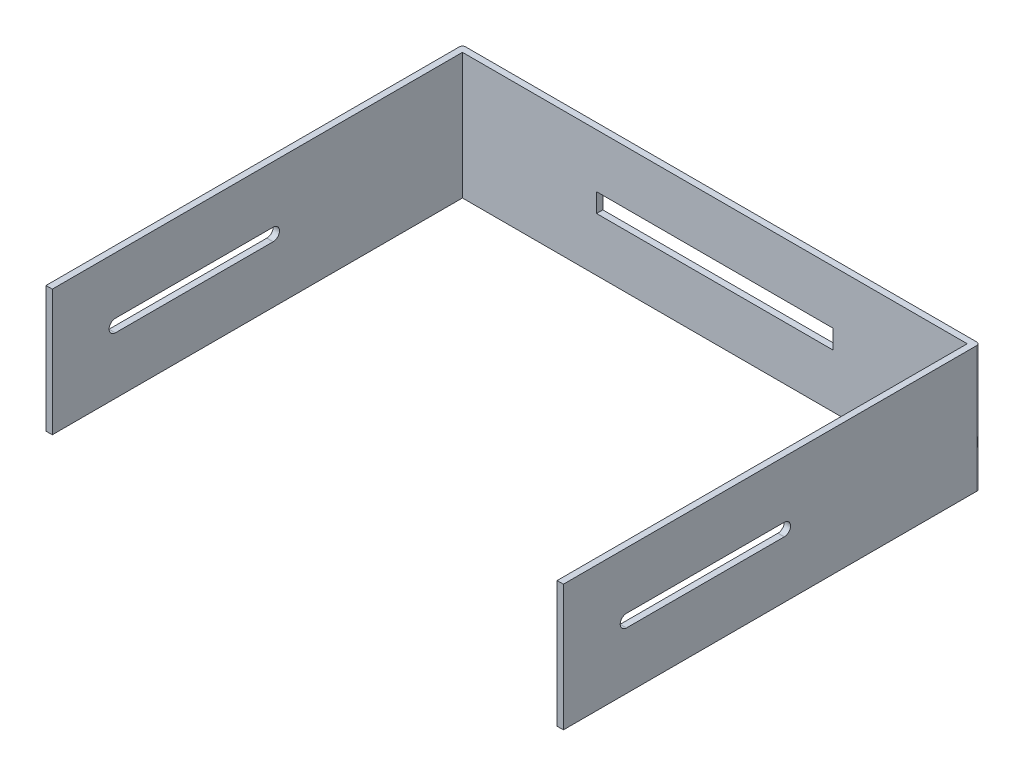
ISO-10303-21;
HEADER;
FILE_DESCRIPTION(('STEP AP214'),'2;1');
FILE_NAME('part.step','',(''),(''),'','','');
FILE_SCHEMA(('AUTOMOTIVE_DESIGN { 1 0 10303 214 1 1 1 1 }'));
ENDSEC;
DATA;
#1=APPLICATION_CONTEXT('core data for automotive mechanical design processes');
#2=APPLICATION_PROTOCOL_DEFINITION('international standard','automotive_design',2000,#1);
#3=PRODUCT_CONTEXT('',#1,'mechanical');
#4=PRODUCT('Part','Part','',(#3));
#5=PRODUCT_RELATED_PRODUCT_CATEGORY('part','',(#4));
#6=PRODUCT_DEFINITION_FORMATION('','',#4);
#7=PRODUCT_DEFINITION_CONTEXT('part definition',#1,'design');
#8=PRODUCT_DEFINITION('design','',#6,#7);
#9=PRODUCT_DEFINITION_SHAPE('','',#8);
#10=(LENGTH_UNIT() NAMED_UNIT(*) SI_UNIT(.MILLI.,.METRE.));
#11=(NAMED_UNIT(*) PLANE_ANGLE_UNIT() SI_UNIT($,.RADIAN.));
#12=(NAMED_UNIT(*) SI_UNIT($,.STERADIAN.) SOLID_ANGLE_UNIT());
#13=UNCERTAINTY_MEASURE_WITH_UNIT(LENGTH_MEASURE(1.E-05),#10,'distance_accuracy_value','');
#14=(GEOMETRIC_REPRESENTATION_CONTEXT(3) GLOBAL_UNCERTAINTY_ASSIGNED_CONTEXT((#13)) GLOBAL_UNIT_ASSIGNED_CONTEXT((#10,
#11,#12)) REPRESENTATION_CONTEXT('',''));
#15=CARTESIAN_POINT('',(0.,0.,0.));
#16=DIRECTION('',(0.,0.,1.));
#17=DIRECTION('',(1.,0.,0.));
#18=AXIS2_PLACEMENT_3D('',#15,#16,#17);
#19=CARTESIAN_POINT('',(0.,0.,2.));
#20=DIRECTION('',(0.,0.,1.));
#21=DIRECTION('',(1.,0.,0.));
#22=AXIS2_PLACEMENT_3D('',#19,#20,#21);
#23=PLANE('',#22);
#24=DIRECTION('',(0.,-1.,0.));
#25=VECTOR('',#24,1.);
#26=CARTESIAN_POINT('',(44.5,-17.,2.));
#27=LINE('',#26,#25);
#28=CARTESIAN_POINT('',(44.5,-17.,2.));
#29=VERTEX_POINT('',#28);
#30=CARTESIAN_POINT('',(44.5,-23.,2.));
#31=VERTEX_POINT('',#30);
#32=EDGE_CURVE('E231',#29,#31,#27,.T.);
#33=ORIENTED_EDGE('',*,*,#32,.F.);
#34=DIRECTION('',(-1.,0.,0.));
#35=VECTOR('',#34,1.);
#36=CARTESIAN_POINT('',(44.5,-17.,2.));
#37=LINE('',#36,#35);
#38=CARTESIAN_POINT('',(119.5,-17.,2.));
#39=VERTEX_POINT('',#38);
#40=EDGE_CURVE('E239',#39,#29,#37,.T.);
#41=ORIENTED_EDGE('',*,*,#40,.F.);
#42=DIRECTION('',(0.,1.,0.));
#43=VECTOR('',#42,1.);
#44=CARTESIAN_POINT('',(119.5,-17.,2.));
#45=LINE('',#44,#43);
#46=CARTESIAN_POINT('',(119.5,-23.,2.));
#47=VERTEX_POINT('',#46);
#48=EDGE_CURVE('E236',#47,#39,#45,.T.);
#49=ORIENTED_EDGE('',*,*,#48,.F.);
#50=DIRECTION('',(1.,0.,0.));
#51=VECTOR('',#50,1.);
#52=CARTESIAN_POINT('',(44.5,-23.,2.));
#53=LINE('',#52,#51);
#54=EDGE_CURVE('E233',#31,#47,#53,.T.);
#55=ORIENTED_EDGE('',*,*,#54,.F.);
#56=EDGE_LOOP('',(#33,#41,#49,#55));
#57=FACE_BOUND('',#56,.T.);
#58=DIRECTION('',(1.,0.,0.));
#59=VECTOR('',#58,1.);
#60=CARTESIAN_POINT('',(0.,-40.,2.));
#61=LINE('',#60,#59);
#62=CARTESIAN_POINT('',(2.,-40.,2.));
#63=VERTEX_POINT('',#62);
#64=CARTESIAN_POINT('',(162.,-40.,2.));
#65=VERTEX_POINT('',#64);
#66=EDGE_CURVE('E299',#63,#65,#61,.T.);
#67=ORIENTED_EDGE('',*,*,#66,.T.);
#68=DIRECTION('',(0.,-1.,0.));
#69=VECTOR('',#68,1.);
#70=CARTESIAN_POINT('',(162.,0.,2.));
#71=LINE('',#70,#69);
#72=CARTESIAN_POINT('',(162.,0.,2.));
#73=VERTEX_POINT('',#72);
#74=EDGE_CURVE('E260',#73,#65,#71,.T.);
#75=ORIENTED_EDGE('',*,*,#74,.F.);
#76=DIRECTION('',(-1.,0.,0.));
#77=VECTOR('',#76,1.);
#78=CARTESIAN_POINT('',(0.,0.,2.));
#79=LINE('',#78,#77);
#80=CARTESIAN_POINT('',(2.,0.,2.));
#81=VERTEX_POINT('',#80);
#82=EDGE_CURVE('E311',#73,#81,#79,.T.);
#83=ORIENTED_EDGE('',*,*,#82,.T.);
#84=DIRECTION('',(0.,1.,0.));
#85=VECTOR('',#84,1.);
#86=CARTESIAN_POINT('',(2.,0.,2.));
#87=LINE('',#86,#85);
#88=EDGE_CURVE('E279',#63,#81,#87,.T.);
#89=ORIENTED_EDGE('',*,*,#88,.F.);
#90=EDGE_LOOP('',(#67,#75,#83,#89));
#91=FACE_BOUND('',#90,.T.);
#92=ADVANCED_FACE('F33',(#57,#91),#23,.T.);
#93=CARTESIAN_POINT('',(0.,0.,2.));
#94=DIRECTION('',(1.,0.,0.));
#95=DIRECTION('',(0.,1.,0.));
#96=AXIS2_PLACEMENT_3D('',#93,#94,#95);
#97=PLANE('',#96);
#98=CARTESIAN_POINT('',(0.,-20.,62.));
#99=DIRECTION('',(-1.,0.,0.));
#100=DIRECTION('',(0.,-1.,0.));
#101=AXIS2_PLACEMENT_3D('',#98,#99,#100);
#102=CIRCLE('',#101,2.);
#103=CARTESIAN_POINT('',(0.,-18.,62.));
#104=VERTEX_POINT('',#103);
#105=CARTESIAN_POINT('',(0.,-22.,62.));
#106=VERTEX_POINT('',#105);
#107=EDGE_CURVE('E208',#104,#106,#102,.T.);
#108=ORIENTED_EDGE('',*,*,#107,.F.);
#109=DIRECTION('',(0.,0.,-1.));
#110=VECTOR('',#109,1.);
#111=CARTESIAN_POINT('',(0.,-18.,62.));
#112=LINE('',#111,#110);
#113=CARTESIAN_POINT('',(0.,-18.,112.));
#114=VERTEX_POINT('',#113);
#115=EDGE_CURVE('E202',#114,#104,#112,.T.);
#116=ORIENTED_EDGE('',*,*,#115,.F.);
#117=CARTESIAN_POINT('',(0.,-20.,112.));
#118=DIRECTION('',(-1.,0.,0.));
#119=DIRECTION('',(0.,-1.,0.));
#120=AXIS2_PLACEMENT_3D('',#117,#118,#119);
#121=CIRCLE('',#120,2.);
#122=CARTESIAN_POINT('',(0.,-22.,112.));
#123=VERTEX_POINT('',#122);
#124=EDGE_CURVE('E245',#123,#114,#121,.T.);
#125=ORIENTED_EDGE('',*,*,#124,.F.);
#126=DIRECTION('',(0.,0.,1.));
#127=VECTOR('',#126,1.);
#128=CARTESIAN_POINT('',(0.,-22.,62.));
#129=LINE('',#128,#127);
#130=EDGE_CURVE('E56',#106,#123,#129,.T.);
#131=ORIENTED_EDGE('',*,*,#130,.F.);
#132=EDGE_LOOP('',(#108,#116,#125,#131));
#133=FACE_BOUND('',#132,.T.);
#134=DIRECTION('',(0.,0.,-1.));
#135=VECTOR('',#134,1.);
#136=CARTESIAN_POINT('',(0.,0.,2.));
#137=LINE('',#136,#135);
#138=CARTESIAN_POINT('',(0.,0.,132.));
#139=VERTEX_POINT('',#138);
#140=CARTESIAN_POINT('',(0.,0.,1.));
#141=VERTEX_POINT('',#140);
#142=EDGE_CURVE('E313',#139,#141,#137,.T.);
#143=ORIENTED_EDGE('',*,*,#142,.T.);
#144=DIRECTION('',(0.,-1.,0.));
#145=VECTOR('',#144,1.);
#146=CARTESIAN_POINT('',(0.,0.,1.));
#147=LINE('',#146,#145);
#148=CARTESIAN_POINT('',(0.,-40.,1.));
#149=VERTEX_POINT('',#148);
#150=EDGE_CURVE('E330',#141,#149,#147,.T.);
#151=ORIENTED_EDGE('',*,*,#150,.T.);
#152=DIRECTION('',(0.,0.,-1.));
#153=VECTOR('',#152,1.);
#154=CARTESIAN_POINT('',(0.,-40.,2.));
#155=LINE('',#154,#153);
#156=CARTESIAN_POINT('',(0.,-40.,132.));
#157=VERTEX_POINT('',#156);
#158=EDGE_CURVE('E328',#157,#149,#155,.T.);
#159=ORIENTED_EDGE('',*,*,#158,.F.);
#160=DIRECTION('',(0.,-1.,0.));
#161=VECTOR('',#160,1.);
#162=CARTESIAN_POINT('',(0.,0.,132.));
#163=LINE('',#162,#161);
#164=EDGE_CURVE('E280',#139,#157,#163,.T.);
#165=ORIENTED_EDGE('',*,*,#164,.F.);
#166=EDGE_LOOP('',(#143,#151,#159,#165));
#167=FACE_BOUND('',#166,.T.);
#168=ADVANCED_FACE('F383',(#133,#167),#97,.F.);
#169=CARTESIAN_POINT('',(0.,-40.,2.));
#170=DIRECTION('',(0.,1.,0.));
#171=DIRECTION('',(0.,0.,1.));
#172=AXIS2_PLACEMENT_3D('',#169,#170,#171);
#173=PLANE('',#172);
#174=DIRECTION('',(1.,0.,0.));
#175=VECTOR('',#174,1.);
#176=CARTESIAN_POINT('',(0.,-40.,0.));
#177=LINE('',#176,#175);
#178=CARTESIAN_POINT('',(1.00000000000001,-40.,0.));
#179=VERTEX_POINT('',#178);
#180=CARTESIAN_POINT('',(163.,-40.,0.));
#181=VERTEX_POINT('',#180);
#182=EDGE_CURVE('E308',#179,#181,#177,.T.);
#183=ORIENTED_EDGE('',*,*,#182,.T.);
#184=CARTESIAN_POINT('',(163.,-40.,1.));
#185=DIRECTION('',(0.,1.,0.));
#186=DIRECTION('',(0.,0.,1.));
#187=AXIS2_PLACEMENT_3D('',#184,#185,#186);
#188=CIRCLE('',#187,1.);
#189=CARTESIAN_POINT('',(164.,-40.,1.));
#190=VERTEX_POINT('',#189);
#191=EDGE_CURVE('E351',#181,#190,#188,.F.);
#192=ORIENTED_EDGE('',*,*,#191,.T.);
#193=DIRECTION('',(0.,0.,-1.));
#194=VECTOR('',#193,1.);
#195=CARTESIAN_POINT('',(164.,-40.,2.));
#196=LINE('',#195,#194);
#197=CARTESIAN_POINT('',(164.,-40.,132.));
#198=VERTEX_POINT('',#197);
#199=EDGE_CURVE('E326',#198,#190,#196,.T.);
#200=ORIENTED_EDGE('',*,*,#199,.F.);
#201=DIRECTION('',(1.,0.,0.));
#202=VECTOR('',#201,1.);
#203=CARTESIAN_POINT('',(164.,-40.,132.));
#204=LINE('',#203,#202);
#205=CARTESIAN_POINT('',(162.,-40.,132.));
#206=VERTEX_POINT('',#205);
#207=EDGE_CURVE('E268',#206,#198,#204,.T.);
#208=ORIENTED_EDGE('',*,*,#207,.F.);
#209=DIRECTION('',(0.,0.,-1.));
#210=VECTOR('',#209,1.);
#211=CARTESIAN_POINT('',(162.,-40.,132.));
#212=LINE('',#211,#210);
#213=EDGE_CURVE('E271',#206,#65,#212,.T.);
#214=ORIENTED_EDGE('',*,*,#213,.T.);
#215=ORIENTED_EDGE('',*,*,#66,.F.);
#216=DIRECTION('',(0.,0.,-1.));
#217=VECTOR('',#216,1.);
#218=CARTESIAN_POINT('',(2.00000000000001,-40.,132.));
#219=LINE('',#218,#217);
#220=CARTESIAN_POINT('',(2.00000000000001,-40.,132.));
#221=VERTEX_POINT('',#220);
#222=EDGE_CURVE('E303',#221,#63,#219,.T.);
#223=ORIENTED_EDGE('',*,*,#222,.F.);
#224=DIRECTION('',(1.,0.,0.));
#225=VECTOR('',#224,1.);
#226=CARTESIAN_POINT('',(0.,-40.,132.));
#227=LINE('',#226,#225);
#228=EDGE_CURVE('E283',#157,#221,#227,.T.);
#229=ORIENTED_EDGE('',*,*,#228,.F.);
#230=ORIENTED_EDGE('',*,*,#158,.T.);
#231=CARTESIAN_POINT('',(1.00000000000001,-40.,1.));
#232=DIRECTION('',(0.,1.,0.));
#233=DIRECTION('',(0.,0.,1.));
#234=AXIS2_PLACEMENT_3D('',#231,#232,#233);
#235=CIRCLE('',#234,1.);
#236=EDGE_CURVE('E334',#149,#179,#235,.F.);
#237=ORIENTED_EDGE('',*,*,#236,.T.);
#238=EDGE_LOOP('',(#183,#192,#200,#208,#214,#215,#223,#229,#230,#237));
#239=FACE_BOUND('',#238,.T.);
#240=ADVANCED_FACE('F403',(#239),#173,.F.);
#241=CARTESIAN_POINT('',(164.,0.,2.));
#242=DIRECTION('',(-1.,0.,0.));
#243=DIRECTION('',(0.,0.,1.));
#244=AXIS2_PLACEMENT_3D('',#241,#242,#243);
#245=PLANE('',#244);
#246=CARTESIAN_POINT('',(164.,-20.,112.));
#247=DIRECTION('',(-1.,0.,0.));
#248=DIRECTION('',(0.,-1.,0.));
#249=AXIS2_PLACEMENT_3D('',#246,#247,#248);
#250=CIRCLE('',#249,2.);
#251=CARTESIAN_POINT('',(164.,-22.,112.));
#252=VERTEX_POINT('',#251);
#253=CARTESIAN_POINT('',(164.,-18.,112.));
#254=VERTEX_POINT('',#253);
#255=EDGE_CURVE('E252',#252,#254,#250,.T.);
#256=ORIENTED_EDGE('',*,*,#255,.T.);
#257=DIRECTION('',(0.,0.,-1.));
#258=VECTOR('',#257,1.);
#259=CARTESIAN_POINT('',(164.,-18.,62.));
#260=LINE('',#259,#258);
#261=CARTESIAN_POINT('',(164.,-18.,62.));
#262=VERTEX_POINT('',#261);
#263=EDGE_CURVE('E198',#254,#262,#260,.T.);
#264=ORIENTED_EDGE('',*,*,#263,.T.);
#265=CARTESIAN_POINT('',(164.,-20.,62.));
#266=DIRECTION('',(-1.,0.,0.));
#267=DIRECTION('',(0.,-1.,0.));
#268=AXIS2_PLACEMENT_3D('',#265,#266,#267);
#269=CIRCLE('',#268,2.);
#270=CARTESIAN_POINT('',(164.,-22.,62.));
#271=VERTEX_POINT('',#270);
#272=EDGE_CURVE('E187',#262,#271,#269,.T.);
#273=ORIENTED_EDGE('',*,*,#272,.T.);
#274=DIRECTION('',(0.,0.,1.));
#275=VECTOR('',#274,1.);
#276=CARTESIAN_POINT('',(164.,-22.,62.));
#277=LINE('',#276,#275);
#278=EDGE_CURVE('E193',#271,#252,#277,.T.);
#279=ORIENTED_EDGE('',*,*,#278,.T.);
#280=EDGE_LOOP('',(#256,#264,#273,#279));
#281=FACE_BOUND('',#280,.T.);
#282=ORIENTED_EDGE('',*,*,#199,.T.);
#283=DIRECTION('',(0.,1.,0.));
#284=VECTOR('',#283,1.);
#285=CARTESIAN_POINT('',(164.,0.,1.));
#286=LINE('',#285,#284);
#287=CARTESIAN_POINT('',(164.,0.,1.));
#288=VERTEX_POINT('',#287);
#289=EDGE_CURVE('E344',#190,#288,#286,.T.);
#290=ORIENTED_EDGE('',*,*,#289,.T.);
#291=DIRECTION('',(0.,0.,-1.));
#292=VECTOR('',#291,1.);
#293=CARTESIAN_POINT('',(164.,0.,2.));
#294=LINE('',#293,#292);
#295=CARTESIAN_POINT('',(164.,0.,132.));
#296=VERTEX_POINT('',#295);
#297=EDGE_CURVE('E323',#296,#288,#294,.T.);
#298=ORIENTED_EDGE('',*,*,#297,.F.);
#299=DIRECTION('',(0.,1.,0.));
#300=VECTOR('',#299,1.);
#301=CARTESIAN_POINT('',(164.,0.,132.));
#302=LINE('',#301,#300);
#303=EDGE_CURVE('E261',#198,#296,#302,.T.);
#304=ORIENTED_EDGE('',*,*,#303,.F.);
#305=EDGE_LOOP('',(#282,#290,#298,#304));
#306=FACE_BOUND('',#305,.T.);
#307=ADVANCED_FACE('F200',(#281,#306),#245,.F.);
#308=CARTESIAN_POINT('',(0.,0.,2.));
#309=DIRECTION('',(0.,-1.,0.));
#310=DIRECTION('',(0.,0.,-1.));
#311=AXIS2_PLACEMENT_3D('',#308,#309,#310);
#312=PLANE('',#311);
#313=ORIENTED_EDGE('',*,*,#297,.T.);
#314=CARTESIAN_POINT('',(163.,0.,1.));
#315=DIRECTION('',(0.,-1.,0.));
#316=DIRECTION('',(0.,0.,-1.));
#317=AXIS2_PLACEMENT_3D('',#314,#315,#316);
#318=CIRCLE('',#317,1.);
#319=CARTESIAN_POINT('',(163.,0.,0.));
#320=VERTEX_POINT('',#319);
#321=EDGE_CURVE('E347',#288,#320,#318,.F.);
#322=ORIENTED_EDGE('',*,*,#321,.T.);
#323=DIRECTION('',(-1.,0.,0.));
#324=VECTOR('',#323,1.);
#325=CARTESIAN_POINT('',(0.,0.,0.));
#326=LINE('',#325,#324);
#327=CARTESIAN_POINT('',(1.,0.,0.));
#328=VERTEX_POINT('',#327);
#329=EDGE_CURVE('E319',#320,#328,#326,.T.);
#330=ORIENTED_EDGE('',*,*,#329,.T.);
#331=CARTESIAN_POINT('',(1.,0.,1.));
#332=DIRECTION('',(0.,-1.,0.));
#333=DIRECTION('',(0.,0.,-1.));
#334=AXIS2_PLACEMENT_3D('',#331,#332,#333);
#335=CIRCLE('',#334,1.);
#336=EDGE_CURVE('E342',#328,#141,#335,.F.);
#337=ORIENTED_EDGE('',*,*,#336,.T.);
#338=ORIENTED_EDGE('',*,*,#142,.F.);
#339=DIRECTION('',(-1.,0.,0.));
#340=VECTOR('',#339,1.);
#341=CARTESIAN_POINT('',(0.,0.,132.));
#342=LINE('',#341,#340);
#343=CARTESIAN_POINT('',(2.,0.,132.));
#344=VERTEX_POINT('',#343);
#345=EDGE_CURVE('E287',#344,#139,#342,.T.);
#346=ORIENTED_EDGE('',*,*,#345,.F.);
#347=DIRECTION('',(0.,0.,-1.));
#348=VECTOR('',#347,1.);
#349=CARTESIAN_POINT('',(2.,0.,132.));
#350=LINE('',#349,#348);
#351=EDGE_CURVE('E290',#344,#81,#350,.T.);
#352=ORIENTED_EDGE('',*,*,#351,.T.);
#353=ORIENTED_EDGE('',*,*,#82,.F.);
#354=DIRECTION('',(0.,0.,-1.));
#355=VECTOR('',#354,1.);
#356=CARTESIAN_POINT('',(162.,0.,132.));
#357=LINE('',#356,#355);
#358=CARTESIAN_POINT('',(162.,0.,132.));
#359=VERTEX_POINT('',#358);
#360=EDGE_CURVE('E276',#359,#73,#357,.T.);
#361=ORIENTED_EDGE('',*,*,#360,.F.);
#362=DIRECTION('',(-1.,0.,0.));
#363=VECTOR('',#362,1.);
#364=CARTESIAN_POINT('',(164.,0.,132.));
#365=LINE('',#364,#363);
#366=EDGE_CURVE('E264',#296,#359,#365,.T.);
#367=ORIENTED_EDGE('',*,*,#366,.F.);
#368=EDGE_LOOP('',(#313,#322,#330,#337,#338,#346,#352,#353,#361,#367));
#369=FACE_BOUND('',#368,.T.);
#370=ADVANCED_FACE('F413',(#369),#312,.F.);
#371=CARTESIAN_POINT('',(0.,0.,0.));
#372=DIRECTION('',(0.,0.,1.));
#373=DIRECTION('',(1.,0.,0.));
#374=AXIS2_PLACEMENT_3D('',#371,#372,#373);
#375=PLANE('',#374);
#376=DIRECTION('',(-1.,0.,0.));
#377=VECTOR('',#376,1.);
#378=CARTESIAN_POINT('',(0.,-17.,0.));
#379=LINE('',#378,#377);
#380=CARTESIAN_POINT('',(119.5,-17.,0.));
#381=VERTEX_POINT('',#380);
#382=CARTESIAN_POINT('',(44.5,-17.,0.));
#383=VERTEX_POINT('',#382);
#384=EDGE_CURVE('E359',#381,#383,#379,.T.);
#385=ORIENTED_EDGE('',*,*,#384,.T.);
#386=DIRECTION('',(0.,-1.,0.));
#387=VECTOR('',#386,1.);
#388=CARTESIAN_POINT('',(44.5,0.,0.));
#389=LINE('',#388,#387);
#390=CARTESIAN_POINT('',(44.5,-23.,0.));
#391=VERTEX_POINT('',#390);
#392=EDGE_CURVE('E362',#383,#391,#389,.T.);
#393=ORIENTED_EDGE('',*,*,#392,.T.);
#394=DIRECTION('',(1.,0.,0.));
#395=VECTOR('',#394,1.);
#396=CARTESIAN_POINT('',(0.,-23.,0.));
#397=LINE('',#396,#395);
#398=CARTESIAN_POINT('',(119.5,-23.,0.));
#399=VERTEX_POINT('',#398);
#400=EDGE_CURVE('E353',#391,#399,#397,.T.);
#401=ORIENTED_EDGE('',*,*,#400,.T.);
#402=DIRECTION('',(0.,1.,0.));
#403=VECTOR('',#402,1.);
#404=CARTESIAN_POINT('',(119.5,0.,0.));
#405=LINE('',#404,#403);
#406=EDGE_CURVE('E356',#399,#381,#405,.T.);
#407=ORIENTED_EDGE('',*,*,#406,.T.);
#408=EDGE_LOOP('',(#385,#393,#401,#407));
#409=FACE_BOUND('',#408,.T.);
#410=ORIENTED_EDGE('',*,*,#329,.F.);
#411=DIRECTION('',(0.,1.,0.));
#412=VECTOR('',#411,1.);
#413=CARTESIAN_POINT('',(163.,0.,0.));
#414=LINE('',#413,#412);
#415=EDGE_CURVE('E349',#320,#181,#414,.F.);
#416=ORIENTED_EDGE('',*,*,#415,.T.);
#417=ORIENTED_EDGE('',*,*,#182,.F.);
#418=DIRECTION('',(0.,-1.,0.));
#419=VECTOR('',#418,1.);
#420=CARTESIAN_POINT('',(1.,0.,0.));
#421=LINE('',#420,#419);
#422=EDGE_CURVE('E337',#179,#328,#421,.F.);
#423=ORIENTED_EDGE('',*,*,#422,.T.);
#424=EDGE_LOOP('',(#410,#416,#417,#423));
#425=FACE_BOUND('',#424,.T.);
#426=ADVANCED_FACE('F410',(#409,#425),#375,.F.);
#427=CARTESIAN_POINT('',(2.,0.,132.));
#428=DIRECTION('',(-1.,0.,0.));
#429=DIRECTION('',(0.,-1.,0.));
#430=AXIS2_PLACEMENT_3D('',#427,#428,#429);
#431=PLANE('',#430);
#432=CARTESIAN_POINT('',(2.,-20.,112.));
#433=DIRECTION('',(-1.,0.,0.));
#434=DIRECTION('',(0.,-1.,0.));
#435=AXIS2_PLACEMENT_3D('',#432,#433,#434);
#436=CIRCLE('',#435,2.);
#437=CARTESIAN_POINT('',(2.,-22.,112.));
#438=VERTEX_POINT('',#437);
#439=CARTESIAN_POINT('',(2.,-18.,112.));
#440=VERTEX_POINT('',#439);
#441=EDGE_CURVE('E257',#438,#440,#436,.T.);
#442=ORIENTED_EDGE('',*,*,#441,.T.);
#443=DIRECTION('',(0.,0.,-1.));
#444=VECTOR('',#443,1.);
#445=CARTESIAN_POINT('',(2.,-18.,132.));
#446=LINE('',#445,#444);
#447=CARTESIAN_POINT('',(2.,-18.,62.));
#448=VERTEX_POINT('',#447);
#449=EDGE_CURVE('E225',#440,#448,#446,.T.);
#450=ORIENTED_EDGE('',*,*,#449,.T.);
#451=CARTESIAN_POINT('',(2.,-20.,62.));
#452=DIRECTION('',(-1.,0.,0.));
#453=DIRECTION('',(0.,-1.,0.));
#454=AXIS2_PLACEMENT_3D('',#451,#452,#453);
#455=CIRCLE('',#454,2.);
#456=CARTESIAN_POINT('',(2.,-22.,62.));
#457=VERTEX_POINT('',#456);
#458=EDGE_CURVE('E228',#448,#457,#455,.T.);
#459=ORIENTED_EDGE('',*,*,#458,.T.);
#460=DIRECTION('',(0.,0.,1.));
#461=VECTOR('',#460,1.);
#462=CARTESIAN_POINT('',(2.,-22.,132.));
#463=LINE('',#462,#461);
#464=EDGE_CURVE('E219',#457,#438,#463,.T.);
#465=ORIENTED_EDGE('',*,*,#464,.T.);
#466=EDGE_LOOP('',(#442,#450,#459,#465));
#467=FACE_BOUND('',#466,.T.);
#468=ORIENTED_EDGE('',*,*,#88,.T.);
#469=ORIENTED_EDGE('',*,*,#351,.F.);
#470=DIRECTION('',(0.,1.,0.));
#471=VECTOR('',#470,1.);
#472=CARTESIAN_POINT('',(2.,0.,132.));
#473=LINE('',#472,#471);
#474=EDGE_CURVE('E285',#221,#344,#473,.T.);
#475=ORIENTED_EDGE('',*,*,#474,.F.);
#476=ORIENTED_EDGE('',*,*,#222,.T.);
#477=EDGE_LOOP('',(#468,#469,#475,#476));
#478=FACE_BOUND('',#477,.T.);
#479=ADVANCED_FACE('F374',(#467,#478),#431,.F.);
#480=CARTESIAN_POINT('',(0.,0.,132.));
#481=DIRECTION('',(0.,0.,1.));
#482=DIRECTION('',(1.,0.,0.));
#483=AXIS2_PLACEMENT_3D('',#480,#481,#482);
#484=PLANE('',#483);
#485=ORIENTED_EDGE('',*,*,#164,.T.);
#486=ORIENTED_EDGE('',*,*,#228,.T.);
#487=ORIENTED_EDGE('',*,*,#474,.T.);
#488=ORIENTED_EDGE('',*,*,#345,.T.);
#489=EDGE_LOOP('',(#485,#486,#487,#488));
#490=FACE_BOUND('',#489,.T.);
#491=ADVANCED_FACE('F438',(#490),#484,.T.);
#492=CARTESIAN_POINT('',(162.,0.,132.));
#493=DIRECTION('',(1.,0.,0.));
#494=DIRECTION('',(0.,0.,-1.));
#495=AXIS2_PLACEMENT_3D('',#492,#493,#494);
#496=PLANE('',#495);
#497=CARTESIAN_POINT('',(162.,-20.,62.));
#498=DIRECTION('',(1.,0.,0.));
#499=DIRECTION('',(0.,0.,-1.));
#500=AXIS2_PLACEMENT_3D('',#497,#498,#499);
#501=CIRCLE('',#500,2.);
#502=CARTESIAN_POINT('',(162.,-22.,62.));
#503=VERTEX_POINT('',#502);
#504=CARTESIAN_POINT('',(162.,-18.,62.));
#505=VERTEX_POINT('',#504);
#506=EDGE_CURVE('E11',#503,#505,#501,.T.);
#507=ORIENTED_EDGE('',*,*,#506,.T.);
#508=DIRECTION('',(0.,0.,1.));
#509=VECTOR('',#508,1.);
#510=CARTESIAN_POINT('',(162.,-18.,132.));
#511=LINE('',#510,#509);
#512=CARTESIAN_POINT('',(162.,-18.,112.));
#513=VERTEX_POINT('',#512);
#514=EDGE_CURVE('E222',#505,#513,#511,.T.);
#515=ORIENTED_EDGE('',*,*,#514,.T.);
#516=CARTESIAN_POINT('',(162.,-20.,112.));
#517=DIRECTION('',(1.,0.,0.));
#518=DIRECTION('',(0.,0.,-1.));
#519=AXIS2_PLACEMENT_3D('',#516,#517,#518);
#520=CIRCLE('',#519,2.);
#521=CARTESIAN_POINT('',(162.,-22.,112.));
#522=VERTEX_POINT('',#521);
#523=EDGE_CURVE('E254',#513,#522,#520,.T.);
#524=ORIENTED_EDGE('',*,*,#523,.T.);
#525=DIRECTION('',(0.,0.,-1.));
#526=VECTOR('',#525,1.);
#527=CARTESIAN_POINT('',(162.,-22.,132.));
#528=LINE('',#527,#526);
#529=EDGE_CURVE('E48',#522,#503,#528,.T.);
#530=ORIENTED_EDGE('',*,*,#529,.T.);
#531=EDGE_LOOP('',(#507,#515,#524,#530));
#532=FACE_BOUND('',#531,.T.);
#533=ORIENTED_EDGE('',*,*,#74,.T.);
#534=ORIENTED_EDGE('',*,*,#213,.F.);
#535=DIRECTION('',(0.,-1.,0.));
#536=VECTOR('',#535,1.);
#537=CARTESIAN_POINT('',(162.,0.,132.));
#538=LINE('',#537,#536);
#539=EDGE_CURVE('E266',#359,#206,#538,.T.);
#540=ORIENTED_EDGE('',*,*,#539,.F.);
#541=ORIENTED_EDGE('',*,*,#360,.T.);
#542=EDGE_LOOP('',(#533,#534,#540,#541));
#543=FACE_BOUND('',#542,.T.);
#544=ADVANCED_FACE('F449',(#532,#543),#496,.F.);
#545=CARTESIAN_POINT('',(0.,0.,132.));
#546=DIRECTION('',(0.,0.,-1.));
#547=DIRECTION('',(-1.,0.,0.));
#548=AXIS2_PLACEMENT_3D('',#545,#546,#547);
#549=PLANE('',#548);
#550=ORIENTED_EDGE('',*,*,#303,.T.);
#551=ORIENTED_EDGE('',*,*,#366,.T.);
#552=ORIENTED_EDGE('',*,*,#539,.T.);
#553=ORIENTED_EDGE('',*,*,#207,.T.);
#554=EDGE_LOOP('',(#550,#551,#552,#553));
#555=FACE_BOUND('',#554,.T.);
#556=ADVANCED_FACE('F453',(#555),#549,.F.);
#557=CARTESIAN_POINT('',(164.,-20.,112.));
#558=DIRECTION('',(-1.,0.,0.));
#559=DIRECTION('',(0.,-1.,0.));
#560=AXIS2_PLACEMENT_3D('',#557,#558,#559);
#561=CYLINDRICAL_SURFACE('',#560,2.);
#562=ORIENTED_EDGE('',*,*,#523,.F.);
#563=DIRECTION('',(-1.,0.,0.));
#564=VECTOR('',#563,1.);
#565=CARTESIAN_POINT('',(164.,-18.,112.));
#566=LINE('',#565,#564);
#567=EDGE_CURVE('E215',#254,#513,#566,.T.);
#568=ORIENTED_EDGE('',*,*,#567,.F.);
#569=ORIENTED_EDGE('',*,*,#255,.F.);
#570=DIRECTION('',(-1.,0.,0.));
#571=VECTOR('',#570,1.);
#572=CARTESIAN_POINT('',(164.,-22.,112.));
#573=LINE('',#572,#571);
#574=EDGE_CURVE('E189',#252,#522,#573,.T.);
#575=ORIENTED_EDGE('',*,*,#574,.T.);
#576=EDGE_LOOP('',(#562,#568,#569,#575));
#577=FACE_BOUND('',#576,.T.);
#578=ADVANCED_FACE('F430',(#577),#561,.F.);
#579=ORIENTED_EDGE('',*,*,#124,.T.);
#580=DIRECTION('',(-1.,0.,0.));
#581=VECTOR('',#580,1.);
#582=CARTESIAN_POINT('',(164.,-18.,112.));
#583=LINE('',#582,#581);
#584=EDGE_CURVE('E41',#114,#440,#583,.F.);
#585=ORIENTED_EDGE('',*,*,#584,.T.);
#586=ORIENTED_EDGE('',*,*,#441,.F.);
#587=DIRECTION('',(-1.,0.,0.));
#588=VECTOR('',#587,1.);
#589=CARTESIAN_POINT('',(164.,-22.,112.));
#590=LINE('',#589,#588);
#591=EDGE_CURVE('E365',#123,#438,#590,.F.);
#592=ORIENTED_EDGE('',*,*,#591,.F.);
#593=EDGE_LOOP('',(#579,#585,#586,#592));
#594=FACE_BOUND('',#593,.T.);
#595=ADVANCED_FACE('F369',(#594),#561,.F.);
#596=CARTESIAN_POINT('',(1.,0.,1.));
#597=DIRECTION('',(0.,-1.,0.));
#598=DIRECTION('',(1.,0.,0.));
#599=AXIS2_PLACEMENT_3D('',#596,#597,#598);
#600=CYLINDRICAL_SURFACE('',#599,1.);
#601=ORIENTED_EDGE('',*,*,#336,.F.);
#602=ORIENTED_EDGE('',*,*,#422,.F.);
#603=ORIENTED_EDGE('',*,*,#236,.F.);
#604=ORIENTED_EDGE('',*,*,#150,.F.);
#605=EDGE_LOOP('',(#601,#602,#603,#604));
#606=FACE_BOUND('',#605,.T.);
#607=ADVANCED_FACE('F421',(#606),#600,.T.);
#608=CARTESIAN_POINT('',(163.,0.,1.));
#609=DIRECTION('',(0.,1.,0.));
#610=DIRECTION('',(0.,0.,1.));
#611=AXIS2_PLACEMENT_3D('',#608,#609,#610);
#612=CYLINDRICAL_SURFACE('',#611,1.);
#613=ORIENTED_EDGE('',*,*,#191,.F.);
#614=ORIENTED_EDGE('',*,*,#415,.F.);
#615=ORIENTED_EDGE('',*,*,#321,.F.);
#616=ORIENTED_EDGE('',*,*,#289,.F.);
#617=EDGE_LOOP('',(#613,#614,#615,#616));
#618=FACE_BOUND('',#617,.T.);
#619=ADVANCED_FACE('F35',(#618),#612,.T.);
#620=CARTESIAN_POINT('',(44.5,-17.,-128.));
#621=DIRECTION('',(-1.,0.,0.));
#622=DIRECTION('',(0.,0.,1.));
#623=AXIS2_PLACEMENT_3D('',#620,#621,#622);
#624=PLANE('',#623);
#625=DIRECTION('',(0.,0.,1.));
#626=VECTOR('',#625,1.);
#627=CARTESIAN_POINT('',(44.5,-17.,-128.));
#628=LINE('',#627,#626);
#629=EDGE_CURVE('E243',#383,#29,#628,.T.);
#630=ORIENTED_EDGE('',*,*,#629,.T.);
#631=ORIENTED_EDGE('',*,*,#32,.T.);
#632=DIRECTION('',(0.,0.,1.));
#633=VECTOR('',#632,1.);
#634=CARTESIAN_POINT('',(44.5,-23.,-128.));
#635=LINE('',#634,#633);
#636=EDGE_CURVE('E242',#391,#31,#635,.T.);
#637=ORIENTED_EDGE('',*,*,#636,.F.);
#638=ORIENTED_EDGE('',*,*,#392,.F.);
#639=EDGE_LOOP('',(#630,#631,#637,#638));
#640=FACE_BOUND('',#639,.T.);
#641=ADVANCED_FACE('F428',(#640),#624,.F.);
#642=CARTESIAN_POINT('',(44.5,-17.,-128.));
#643=DIRECTION('',(0.,1.,0.));
#644=DIRECTION('',(-1.,0.,0.));
#645=AXIS2_PLACEMENT_3D('',#642,#643,#644);
#646=PLANE('',#645);
#647=DIRECTION('',(0.,0.,1.));
#648=VECTOR('',#647,1.);
#649=CARTESIAN_POINT('',(119.5,-17.,-128.));
#650=LINE('',#649,#648);
#651=EDGE_CURVE('E246',#381,#39,#650,.T.);
#652=ORIENTED_EDGE('',*,*,#651,.T.);
#653=ORIENTED_EDGE('',*,*,#40,.T.);
#654=ORIENTED_EDGE('',*,*,#629,.F.);
#655=ORIENTED_EDGE('',*,*,#384,.F.);
#656=EDGE_LOOP('',(#652,#653,#654,#655));
#657=FACE_BOUND('',#656,.T.);
#658=ADVANCED_FACE('F520',(#657),#646,.F.);
#659=CARTESIAN_POINT('',(119.5,-17.,-128.));
#660=DIRECTION('',(1.,0.,0.));
#661=DIRECTION('',(0.,0.,-1.));
#662=AXIS2_PLACEMENT_3D('',#659,#660,#661);
#663=PLANE('',#662);
#664=DIRECTION('',(0.,0.,1.));
#665=VECTOR('',#664,1.);
#666=CARTESIAN_POINT('',(119.5,-23.,-128.));
#667=LINE('',#666,#665);
#668=EDGE_CURVE('E248',#399,#47,#667,.T.);
#669=ORIENTED_EDGE('',*,*,#668,.T.);
#670=ORIENTED_EDGE('',*,*,#48,.T.);
#671=ORIENTED_EDGE('',*,*,#651,.F.);
#672=ORIENTED_EDGE('',*,*,#406,.F.);
#673=EDGE_LOOP('',(#669,#670,#671,#672));
#674=FACE_BOUND('',#673,.T.);
#675=ADVANCED_FACE('F509',(#674),#663,.F.);
#676=CARTESIAN_POINT('',(44.5,-23.,-128.));
#677=DIRECTION('',(0.,-1.,0.));
#678=DIRECTION('',(1.,0.,0.));
#679=AXIS2_PLACEMENT_3D('',#676,#677,#678);
#680=PLANE('',#679);
#681=ORIENTED_EDGE('',*,*,#636,.T.);
#682=ORIENTED_EDGE('',*,*,#54,.T.);
#683=ORIENTED_EDGE('',*,*,#668,.F.);
#684=ORIENTED_EDGE('',*,*,#400,.F.);
#685=EDGE_LOOP('',(#681,#682,#683,#684));
#686=FACE_BOUND('',#685,.T.);
#687=ADVANCED_FACE('F393',(#686),#680,.F.);
#688=CARTESIAN_POINT('',(164.,-22.,62.));
#689=DIRECTION('',(0.,-1.,0.));
#690=DIRECTION('',(1.,0.,0.));
#691=AXIS2_PLACEMENT_3D('',#688,#689,#690);
#692=PLANE('',#691);
#693=DIRECTION('',(-1.,0.,0.));
#694=VECTOR('',#693,1.);
#695=CARTESIAN_POINT('',(164.,-22.,62.));
#696=LINE('',#695,#694);
#697=EDGE_CURVE('E190',#457,#106,#696,.T.);
#698=ORIENTED_EDGE('',*,*,#697,.T.);
#699=ORIENTED_EDGE('',*,*,#130,.T.);
#700=ORIENTED_EDGE('',*,*,#591,.T.);
#701=ORIENTED_EDGE('',*,*,#464,.F.);
#702=EDGE_LOOP('',(#698,#699,#700,#701));
#703=FACE_BOUND('',#702,.T.);
#704=ADVANCED_FACE('F377',(#703),#692,.F.);
#705=CARTESIAN_POINT('',(164.,-18.,62.));
#706=DIRECTION('',(0.,1.,0.));
#707=DIRECTION('',(-1.,0.,0.));
#708=AXIS2_PLACEMENT_3D('',#705,#706,#707);
#709=PLANE('',#708);
#710=ORIENTED_EDGE('',*,*,#584,.F.);
#711=ORIENTED_EDGE('',*,*,#115,.T.);
#712=DIRECTION('',(-1.,0.,0.));
#713=VECTOR('',#712,1.);
#714=CARTESIAN_POINT('',(164.,-18.,62.));
#715=LINE('',#714,#713);
#716=EDGE_CURVE('E214',#448,#104,#715,.T.);
#717=ORIENTED_EDGE('',*,*,#716,.F.);
#718=ORIENTED_EDGE('',*,*,#449,.F.);
#719=EDGE_LOOP('',(#710,#711,#717,#718));
#720=FACE_BOUND('',#719,.T.);
#721=ADVANCED_FACE('F384',(#720),#709,.F.);
#722=CARTESIAN_POINT('',(164.,-20.,62.));
#723=DIRECTION('',(-1.,0.,0.));
#724=DIRECTION('',(0.,-1.,0.));
#725=AXIS2_PLACEMENT_3D('',#722,#723,#724);
#726=CYLINDRICAL_SURFACE('',#725,2.);
#727=ORIENTED_EDGE('',*,*,#716,.T.);
#728=ORIENTED_EDGE('',*,*,#107,.T.);
#729=ORIENTED_EDGE('',*,*,#697,.F.);
#730=ORIENTED_EDGE('',*,*,#458,.F.);
#731=EDGE_LOOP('',(#727,#728,#729,#730));
#732=FACE_BOUND('',#731,.T.);
#733=ADVANCED_FACE('F379',(#732),#726,.F.);
#734=EDGE_CURVE('E182',#271,#503,#696,.T.);
#735=ORIENTED_EDGE('',*,*,#734,.F.);
#736=ORIENTED_EDGE('',*,*,#272,.F.);
#737=EDGE_CURVE('E212',#262,#505,#715,.T.);
#738=ORIENTED_EDGE('',*,*,#737,.T.);
#739=ORIENTED_EDGE('',*,*,#506,.F.);
#740=EDGE_LOOP('',(#735,#736,#738,#739));
#741=FACE_BOUND('',#740,.T.);
#742=ADVANCED_FACE('F184',(#741),#726,.F.);
#743=ORIENTED_EDGE('',*,*,#737,.F.);
#744=ORIENTED_EDGE('',*,*,#263,.F.);
#745=ORIENTED_EDGE('',*,*,#567,.T.);
#746=ORIENTED_EDGE('',*,*,#514,.F.);
#747=EDGE_LOOP('',(#743,#744,#745,#746));
#748=FACE_BOUND('',#747,.T.);
#749=ADVANCED_FACE('F387',(#748),#709,.F.);
#750=ORIENTED_EDGE('',*,*,#574,.F.);
#751=ORIENTED_EDGE('',*,*,#278,.F.);
#752=ORIENTED_EDGE('',*,*,#734,.T.);
#753=ORIENTED_EDGE('',*,*,#529,.F.);
#754=EDGE_LOOP('',(#750,#751,#752,#753));
#755=FACE_BOUND('',#754,.T.);
#756=ADVANCED_FACE('F194',(#755),#692,.F.);
#757=CLOSED_SHELL('',(#92,#168,#240,#307,#370,#426,#479,#491,#544,#556,#578,#595,#607,#619,#641,
#658,#675,#687,#704,#721,#733,#742,#749,#756));
#758=MANIFOLD_SOLID_BREP('B2',#757);
#759=ADVANCED_BREP_SHAPE_REPRESENTATION('',(#18,#758),#14);
#760=SHAPE_DEFINITION_REPRESENTATION(#9,#759);
ENDSEC;
END-ISO-10303-21;
